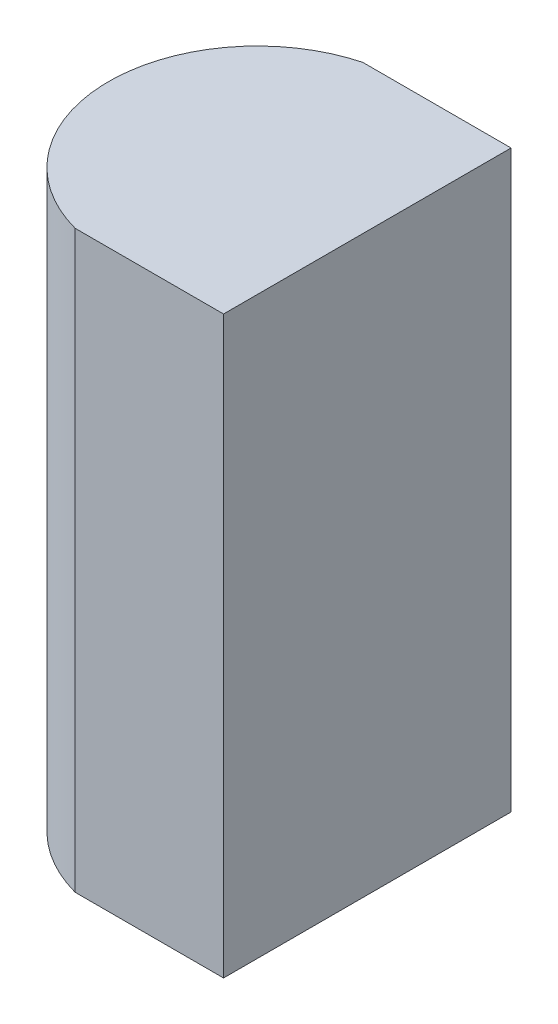
ISO-10303-21;
HEADER;
FILE_DESCRIPTION(('STEP AP214'),'2;1');
FILE_NAME('part.step','',(''),(''),'','','');
FILE_SCHEMA(('AUTOMOTIVE_DESIGN { 1 0 10303 214 1 1 1 1 }'));
ENDSEC;
DATA;
#1=APPLICATION_CONTEXT('core data for automotive mechanical design processes');
#2=APPLICATION_PROTOCOL_DEFINITION('international standard','automotive_design',2000,#1);
#3=PRODUCT_CONTEXT('',#1,'mechanical');
#4=PRODUCT('Part','Part','',(#3));
#5=PRODUCT_RELATED_PRODUCT_CATEGORY('part','',(#4));
#6=PRODUCT_DEFINITION_FORMATION('','',#4);
#7=PRODUCT_DEFINITION_CONTEXT('part definition',#1,'design');
#8=PRODUCT_DEFINITION('design','',#6,#7);
#9=PRODUCT_DEFINITION_SHAPE('','',#8);
#10=(LENGTH_UNIT() NAMED_UNIT(*) SI_UNIT(.MILLI.,.METRE.));
#11=(NAMED_UNIT(*) PLANE_ANGLE_UNIT() SI_UNIT($,.RADIAN.));
#12=(NAMED_UNIT(*) SI_UNIT($,.STERADIAN.) SOLID_ANGLE_UNIT());
#13=UNCERTAINTY_MEASURE_WITH_UNIT(LENGTH_MEASURE(1.E-05),#10,'distance_accuracy_value','');
#14=(GEOMETRIC_REPRESENTATION_CONTEXT(3) GLOBAL_UNCERTAINTY_ASSIGNED_CONTEXT((#13)) GLOBAL_UNIT_ASSIGNED_CONTEXT((#10,
#11,#12)) REPRESENTATION_CONTEXT('',''));
#15=CARTESIAN_POINT('',(0.,0.,0.));
#16=DIRECTION('',(0.,0.,1.));
#17=DIRECTION('',(1.,0.,0.));
#18=AXIS2_PLACEMENT_3D('',#15,#16,#17);
#19=CARTESIAN_POINT('',(0.,8.,0.));
#20=DIRECTION('',(0.,0.,1.));
#21=DIRECTION('',(1.,0.,0.));
#22=AXIS2_PLACEMENT_3D('',#19,#20,#21);
#23=PLANE('',#22);
#24=DIRECTION('',(-1.,0.,0.));
#25=VECTOR('',#24,1.);
#26=CARTESIAN_POINT('',(0.,0.,0.));
#27=LINE('',#26,#25);
#28=CARTESIAN_POINT('',(0.,0.,0.));
#29=VERTEX_POINT('',#28);
#30=CARTESIAN_POINT('',(-2.0637602458033,0.,0.));
#31=VERTEX_POINT('',#30);
#32=EDGE_CURVE('E100',#29,#31,#27,.T.);
#33=ORIENTED_EDGE('',*,*,#32,.T.);
#34=DIRECTION('',(0.,-1.,0.));
#35=VECTOR('',#34,1.);
#36=CARTESIAN_POINT('',(-2.0637602458033,8.,0.));
#37=LINE('',#36,#35);
#38=CARTESIAN_POINT('',(-2.0637602458033,8.,0.));
#39=VERTEX_POINT('',#38);
#40=EDGE_CURVE('E11',#39,#31,#37,.T.);
#41=ORIENTED_EDGE('',*,*,#40,.F.);
#42=DIRECTION('',(-1.,0.,0.));
#43=VECTOR('',#42,1.);
#44=CARTESIAN_POINT('',(0.,8.,0.));
#45=LINE('',#44,#43);
#46=CARTESIAN_POINT('',(0.,8.,0.));
#47=VERTEX_POINT('',#46);
#48=EDGE_CURVE('E88',#47,#39,#45,.T.);
#49=ORIENTED_EDGE('',*,*,#48,.F.);
#50=DIRECTION('',(0.,-1.,0.));
#51=VECTOR('',#50,1.);
#52=CARTESIAN_POINT('',(0.,8.,0.));
#53=LINE('',#52,#51);
#54=EDGE_CURVE('E96',#47,#29,#53,.T.);
#55=ORIENTED_EDGE('',*,*,#54,.T.);
#56=EDGE_LOOP('',(#33,#41,#49,#55));
#57=FACE_BOUND('',#56,.T.);
#58=ADVANCED_FACE('F37',(#57),#23,.F.);
#59=CARTESIAN_POINT('',(-1.53,8.,2.));
#60=DIRECTION('',(0.,-1.,0.));
#61=DIRECTION('',(0.,0.,-1.));
#62=AXIS2_PLACEMENT_3D('',#59,#60,#61);
#63=CYLINDRICAL_SURFACE('',#62,2.07);
#64=CARTESIAN_POINT('',(-1.53,0.,2.));
#65=DIRECTION('',(0.,1.,0.));
#66=DIRECTION('',(0.,0.,1.));
#67=AXIS2_PLACEMENT_3D('',#64,#65,#66);
#68=CIRCLE('',#67,2.07);
#69=CARTESIAN_POINT('',(-2.0637602458033,0.,4.));
#70=VERTEX_POINT('',#69);
#71=EDGE_CURVE('E92',#31,#70,#68,.T.);
#72=ORIENTED_EDGE('',*,*,#71,.T.);
#73=DIRECTION('',(0.,-1.,0.));
#74=VECTOR('',#73,1.);
#75=CARTESIAN_POINT('',(-2.0637602458033,8.,4.));
#76=LINE('',#75,#74);
#77=CARTESIAN_POINT('',(-2.0637602458033,8.,4.));
#78=VERTEX_POINT('',#77);
#79=EDGE_CURVE('E45',#78,#70,#76,.T.);
#80=ORIENTED_EDGE('',*,*,#79,.F.);
#81=CARTESIAN_POINT('',(-1.53,8.,2.));
#82=DIRECTION('',(0.,1.,0.));
#83=DIRECTION('',(0.,0.,1.));
#84=AXIS2_PLACEMENT_3D('',#81,#82,#83);
#85=CIRCLE('',#84,2.07);
#86=EDGE_CURVE('E83',#39,#78,#85,.T.);
#87=ORIENTED_EDGE('',*,*,#86,.F.);
#88=ORIENTED_EDGE('',*,*,#40,.T.);
#89=EDGE_LOOP('',(#72,#80,#87,#88));
#90=FACE_BOUND('',#89,.T.);
#91=ADVANCED_FACE('F91',(#90),#63,.T.);
#92=CARTESIAN_POINT('',(0.,8.,4.));
#93=DIRECTION('',(0.,0.,-1.));
#94=DIRECTION('',(-1.,0.,0.));
#95=AXIS2_PLACEMENT_3D('',#92,#93,#94);
#96=PLANE('',#95);
#97=DIRECTION('',(1.,0.,0.));
#98=VECTOR('',#97,1.);
#99=CARTESIAN_POINT('',(0.,0.,4.));
#100=LINE('',#99,#98);
#101=CARTESIAN_POINT('',(0.,0.,4.));
#102=VERTEX_POINT('',#101);
#103=EDGE_CURVE('E70',#70,#102,#100,.T.);
#104=ORIENTED_EDGE('',*,*,#103,.T.);
#105=DIRECTION('',(0.,-1.,0.));
#106=VECTOR('',#105,1.);
#107=CARTESIAN_POINT('',(0.,8.,4.));
#108=LINE('',#107,#106);
#109=CARTESIAN_POINT('',(0.,8.,4.));
#110=VERTEX_POINT('',#109);
#111=EDGE_CURVE('E93',#110,#102,#108,.T.);
#112=ORIENTED_EDGE('',*,*,#111,.F.);
#113=DIRECTION('',(1.,0.,0.));
#114=VECTOR('',#113,1.);
#115=CARTESIAN_POINT('',(0.,8.,4.));
#116=LINE('',#115,#114);
#117=EDGE_CURVE('E86',#78,#110,#116,.T.);
#118=ORIENTED_EDGE('',*,*,#117,.F.);
#119=ORIENTED_EDGE('',*,*,#79,.T.);
#120=EDGE_LOOP('',(#104,#112,#118,#119));
#121=FACE_BOUND('',#120,.T.);
#122=ADVANCED_FACE('F94',(#121),#96,.F.);
#123=CARTESIAN_POINT('',(0.,8.,0.));
#124=DIRECTION('',(-1.,0.,0.));
#125=DIRECTION('',(0.,0.,1.));
#126=AXIS2_PLACEMENT_3D('',#123,#124,#125);
#127=PLANE('',#126);
#128=DIRECTION('',(0.,0.,-1.));
#129=VECTOR('',#128,1.);
#130=CARTESIAN_POINT('',(0.,0.,0.));
#131=LINE('',#130,#129);
#132=EDGE_CURVE('E76',#102,#29,#131,.T.);
#133=ORIENTED_EDGE('',*,*,#132,.T.);
#134=ORIENTED_EDGE('',*,*,#54,.F.);
#135=DIRECTION('',(0.,0.,-1.));
#136=VECTOR('',#135,1.);
#137=CARTESIAN_POINT('',(0.,8.,0.));
#138=LINE('',#137,#136);
#139=EDGE_CURVE('E53',#110,#47,#138,.T.);
#140=ORIENTED_EDGE('',*,*,#139,.F.);
#141=ORIENTED_EDGE('',*,*,#111,.T.);
#142=EDGE_LOOP('',(#133,#134,#140,#141));
#143=FACE_BOUND('',#142,.T.);
#144=ADVANCED_FACE('F107',(#143),#127,.F.);
#145=CARTESIAN_POINT('',(-1.53,8.,2.));
#146=DIRECTION('',(0.,1.,0.));
#147=DIRECTION('',(0.,0.,1.));
#148=AXIS2_PLACEMENT_3D('',#145,#146,#147);
#149=PLANE('',#148);
#150=ORIENTED_EDGE('',*,*,#48,.T.);
#151=ORIENTED_EDGE('',*,*,#86,.T.);
#152=ORIENTED_EDGE('',*,*,#117,.T.);
#153=ORIENTED_EDGE('',*,*,#139,.T.);
#154=EDGE_LOOP('',(#150,#151,#152,#153));
#155=FACE_BOUND('',#154,.T.);
#156=ADVANCED_FACE('F84',(#155),#149,.T.);
#157=CARTESIAN_POINT('',(-1.53,0.,2.));
#158=DIRECTION('',(0.,1.,0.));
#159=DIRECTION('',(0.,0.,1.));
#160=AXIS2_PLACEMENT_3D('',#157,#158,#159);
#161=PLANE('',#160);
#162=ORIENTED_EDGE('',*,*,#32,.F.);
#163=ORIENTED_EDGE('',*,*,#132,.F.);
#164=ORIENTED_EDGE('',*,*,#103,.F.);
#165=ORIENTED_EDGE('',*,*,#71,.F.);
#166=EDGE_LOOP('',(#162,#163,#164,#165));
#167=FACE_BOUND('',#166,.T.);
#168=ADVANCED_FACE('F110',(#167),#161,.F.);
#169=CLOSED_SHELL('',(#58,#91,#122,#144,#156,#168));
#170=MANIFOLD_SOLID_BREP('B2',#169);
#171=ADVANCED_BREP_SHAPE_REPRESENTATION('',(#18,#170),#14);
#172=SHAPE_DEFINITION_REPRESENTATION(#9,#171);
ENDSEC;
END-ISO-10303-21;
